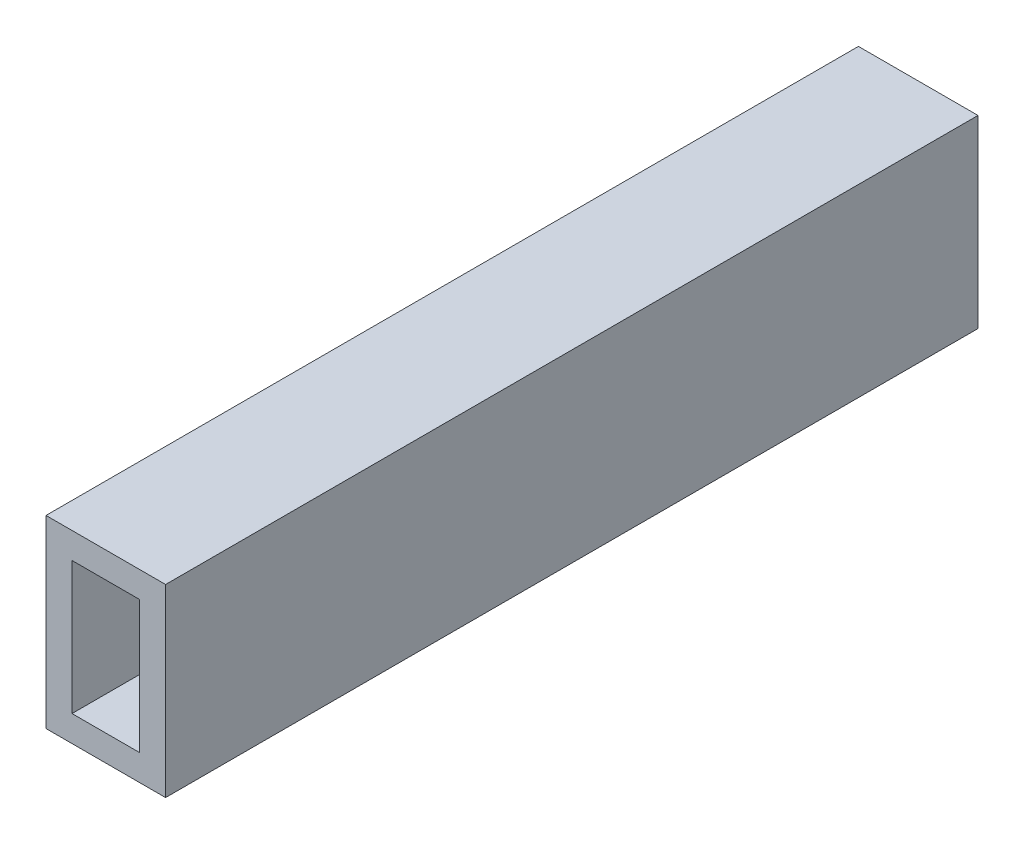
ISO-10303-21;
HEADER;
FILE_DESCRIPTION(('STEP AP214'),'2;1');
FILE_NAME('part.step','',(''),(''),'','','');
FILE_SCHEMA(('AUTOMOTIVE_DESIGN { 1 0 10303 214 1 1 1 1 }'));
ENDSEC;
DATA;
#1=APPLICATION_CONTEXT('core data for automotive mechanical design processes');
#2=APPLICATION_PROTOCOL_DEFINITION('international standard','automotive_design',2000,#1);
#3=PRODUCT_CONTEXT('',#1,'mechanical');
#4=PRODUCT('Part','Part','',(#3));
#5=PRODUCT_RELATED_PRODUCT_CATEGORY('part','',(#4));
#6=PRODUCT_DEFINITION_FORMATION('','',#4);
#7=PRODUCT_DEFINITION_CONTEXT('part definition',#1,'design');
#8=PRODUCT_DEFINITION('design','',#6,#7);
#9=PRODUCT_DEFINITION_SHAPE('','',#8);
#10=(LENGTH_UNIT() NAMED_UNIT(*) SI_UNIT(.MILLI.,.METRE.));
#11=(NAMED_UNIT(*) PLANE_ANGLE_UNIT() SI_UNIT($,.RADIAN.));
#12=(NAMED_UNIT(*) SI_UNIT($,.STERADIAN.) SOLID_ANGLE_UNIT());
#13=UNCERTAINTY_MEASURE_WITH_UNIT(LENGTH_MEASURE(1.E-05),#10,'distance_accuracy_value','');
#14=(GEOMETRIC_REPRESENTATION_CONTEXT(3) GLOBAL_UNCERTAINTY_ASSIGNED_CONTEXT((#13)) GLOBAL_UNIT_ASSIGNED_CONTEXT((#10,
#11,#12)) REPRESENTATION_CONTEXT('',''));
#15=CARTESIAN_POINT('',(0.,0.,0.));
#16=DIRECTION('',(0.,0.,1.));
#17=DIRECTION('',(1.,0.,0.));
#18=AXIS2_PLACEMENT_3D('',#15,#16,#17);
#19=CARTESIAN_POINT('',(0.,0.,31.25));
#20=DIRECTION('',(0.,0.,-1.));
#21=DIRECTION('',(-1.,0.,0.));
#22=AXIS2_PLACEMENT_3D('',#19,#20,#21);
#23=PLANE('',#22);
#24=DIRECTION('',(0.,1.,0.));
#25=VECTOR('',#24,1.);
#26=CARTESIAN_POINT('',(2.3,-3.55,31.25));
#27=LINE('',#26,#25);
#28=CARTESIAN_POINT('',(2.3,-3.55,31.25));
#29=VERTEX_POINT('',#28);
#30=CARTESIAN_POINT('',(2.3,3.55,31.25));
#31=VERTEX_POINT('',#30);
#32=EDGE_CURVE('E153',#29,#31,#27,.T.);
#33=ORIENTED_EDGE('',*,*,#32,.T.);
#34=DIRECTION('',(-1.,0.,0.));
#35=VECTOR('',#34,1.);
#36=CARTESIAN_POINT('',(-2.3,3.55,31.25));
#37=LINE('',#36,#35);
#38=CARTESIAN_POINT('',(-2.3,3.55,31.25));
#39=VERTEX_POINT('',#38);
#40=EDGE_CURVE('E157',#31,#39,#37,.T.);
#41=ORIENTED_EDGE('',*,*,#40,.T.);
#42=DIRECTION('',(0.,-1.,0.));
#43=VECTOR('',#42,1.);
#44=CARTESIAN_POINT('',(-2.3,-3.55,31.25));
#45=LINE('',#44,#43);
#46=CARTESIAN_POINT('',(-2.3,-3.55,31.25));
#47=VERTEX_POINT('',#46);
#48=EDGE_CURVE('E161',#39,#47,#45,.T.);
#49=ORIENTED_EDGE('',*,*,#48,.T.);
#50=DIRECTION('',(1.,0.,0.));
#51=VECTOR('',#50,1.);
#52=CARTESIAN_POINT('',(-2.3,-3.55,31.25));
#53=LINE('',#52,#51);
#54=EDGE_CURVE('E164',#47,#29,#53,.T.);
#55=ORIENTED_EDGE('',*,*,#54,.T.);
#56=EDGE_LOOP('',(#33,#41,#49,#55));
#57=FACE_BOUND('',#56,.T.);
#58=DIRECTION('',(0.,-1.,0.));
#59=VECTOR('',#58,1.);
#60=CARTESIAN_POINT('',(-1.3,-2.55,31.25));
#61=LINE('',#60,#59);
#62=CARTESIAN_POINT('',(-1.3,2.55,31.25));
#63=VERTEX_POINT('',#62);
#64=CARTESIAN_POINT('',(-1.3,-2.55,31.25));
#65=VERTEX_POINT('',#64);
#66=EDGE_CURVE('E105',#63,#65,#61,.T.);
#67=ORIENTED_EDGE('',*,*,#66,.F.);
#68=DIRECTION('',(-1.,0.,0.));
#69=VECTOR('',#68,1.);
#70=CARTESIAN_POINT('',(1.3,2.55,31.25));
#71=LINE('',#70,#69);
#72=CARTESIAN_POINT('',(1.3,2.55,31.25));
#73=VERTEX_POINT('',#72);
#74=EDGE_CURVE('E131',#73,#63,#71,.T.);
#75=ORIENTED_EDGE('',*,*,#74,.F.);
#76=DIRECTION('',(0.,1.,0.));
#77=VECTOR('',#76,1.);
#78=CARTESIAN_POINT('',(1.3,-2.55,31.25));
#79=LINE('',#78,#77);
#80=CARTESIAN_POINT('',(1.3,-2.55,31.25));
#81=VERTEX_POINT('',#80);
#82=EDGE_CURVE('E127',#81,#73,#79,.T.);
#83=ORIENTED_EDGE('',*,*,#82,.F.);
#84=DIRECTION('',(1.,0.,0.));
#85=VECTOR('',#84,1.);
#86=CARTESIAN_POINT('',(1.3,-2.55,31.25));
#87=LINE('',#86,#85);
#88=EDGE_CURVE('E114',#65,#81,#87,.T.);
#89=ORIENTED_EDGE('',*,*,#88,.F.);
#90=EDGE_LOOP('',(#67,#75,#83,#89));
#91=FACE_BOUND('',#90,.T.);
#92=ADVANCED_FACE('F39',(#57,#91),#23,.F.);
#93=CARTESIAN_POINT('',(0.,0.,0.));
#94=DIRECTION('',(0.,0.,-1.));
#95=DIRECTION('',(-1.,0.,0.));
#96=AXIS2_PLACEMENT_3D('',#93,#94,#95);
#97=PLANE('',#96);
#98=DIRECTION('',(0.,1.,0.));
#99=VECTOR('',#98,1.);
#100=CARTESIAN_POINT('',(2.3,-3.55,0.));
#101=LINE('',#100,#99);
#102=CARTESIAN_POINT('',(2.3,-3.55,0.));
#103=VERTEX_POINT('',#102);
#104=CARTESIAN_POINT('',(2.3,3.55,0.));
#105=VERTEX_POINT('',#104);
#106=EDGE_CURVE('E123',#103,#105,#101,.T.);
#107=ORIENTED_EDGE('',*,*,#106,.F.);
#108=DIRECTION('',(1.,0.,0.));
#109=VECTOR('',#108,1.);
#110=CARTESIAN_POINT('',(-2.3,-3.55,0.));
#111=LINE('',#110,#109);
#112=CARTESIAN_POINT('',(-2.3,-3.55,0.));
#113=VERTEX_POINT('',#112);
#114=EDGE_CURVE('E158',#113,#103,#111,.T.);
#115=ORIENTED_EDGE('',*,*,#114,.F.);
#116=DIRECTION('',(0.,-1.,0.));
#117=VECTOR('',#116,1.);
#118=CARTESIAN_POINT('',(-2.3,-3.55,0.));
#119=LINE('',#118,#117);
#120=CARTESIAN_POINT('',(-2.3,3.55,0.));
#121=VERTEX_POINT('',#120);
#122=EDGE_CURVE('E174',#121,#113,#119,.T.);
#123=ORIENTED_EDGE('',*,*,#122,.F.);
#124=DIRECTION('',(-1.,0.,0.));
#125=VECTOR('',#124,1.);
#126=CARTESIAN_POINT('',(-2.3,3.55,0.));
#127=LINE('',#126,#125);
#128=EDGE_CURVE('E171',#105,#121,#127,.T.);
#129=ORIENTED_EDGE('',*,*,#128,.F.);
#130=EDGE_LOOP('',(#107,#115,#123,#129));
#131=FACE_BOUND('',#130,.T.);
#132=DIRECTION('',(-1.,0.,0.));
#133=VECTOR('',#132,1.);
#134=CARTESIAN_POINT('',(1.3,2.55,0.));
#135=LINE('',#134,#133);
#136=CARTESIAN_POINT('',(1.3,2.55,0.));
#137=VERTEX_POINT('',#136);
#138=CARTESIAN_POINT('',(-1.3,2.55,0.));
#139=VERTEX_POINT('',#138);
#140=EDGE_CURVE('E115',#137,#139,#135,.T.);
#141=ORIENTED_EDGE('',*,*,#140,.T.);
#142=DIRECTION('',(0.,-1.,0.));
#143=VECTOR('',#142,1.);
#144=CARTESIAN_POINT('',(-1.3,-2.55,0.));
#145=LINE('',#144,#143);
#146=CARTESIAN_POINT('',(-1.3,-2.55,0.));
#147=VERTEX_POINT('',#146);
#148=EDGE_CURVE('E63',#139,#147,#145,.T.);
#149=ORIENTED_EDGE('',*,*,#148,.T.);
#150=DIRECTION('',(1.,0.,0.));
#151=VECTOR('',#150,1.);
#152=CARTESIAN_POINT('',(1.3,-2.55,0.));
#153=LINE('',#152,#151);
#154=CARTESIAN_POINT('',(1.3,-2.55,0.));
#155=VERTEX_POINT('',#154);
#156=EDGE_CURVE('E121',#147,#155,#153,.T.);
#157=ORIENTED_EDGE('',*,*,#156,.T.);
#158=DIRECTION('',(0.,1.,0.));
#159=VECTOR('',#158,1.);
#160=CARTESIAN_POINT('',(1.3,-2.55,0.));
#161=LINE('',#160,#159);
#162=EDGE_CURVE('E140',#155,#137,#161,.T.);
#163=ORIENTED_EDGE('',*,*,#162,.T.);
#164=EDGE_LOOP('',(#141,#149,#157,#163));
#165=FACE_BOUND('',#164,.T.);
#166=ADVANCED_FACE('F197',(#131,#165),#97,.T.);
#167=CARTESIAN_POINT('',(2.3,-3.55,31.25));
#168=DIRECTION('',(-1.,0.,0.));
#169=DIRECTION('',(0.,0.,1.));
#170=AXIS2_PLACEMENT_3D('',#167,#168,#169);
#171=PLANE('',#170);
#172=ORIENTED_EDGE('',*,*,#106,.T.);
#173=DIRECTION('',(0.,0.,-1.));
#174=VECTOR('',#173,1.);
#175=CARTESIAN_POINT('',(2.3,3.55,31.25));
#176=LINE('',#175,#174);
#177=EDGE_CURVE('E11',#31,#105,#176,.T.);
#178=ORIENTED_EDGE('',*,*,#177,.F.);
#179=ORIENTED_EDGE('',*,*,#32,.F.);
#180=DIRECTION('',(0.,0.,-1.));
#181=VECTOR('',#180,1.);
#182=CARTESIAN_POINT('',(2.3,-3.55,31.25));
#183=LINE('',#182,#181);
#184=EDGE_CURVE('E167',#29,#103,#183,.T.);
#185=ORIENTED_EDGE('',*,*,#184,.T.);
#186=EDGE_LOOP('',(#172,#178,#179,#185));
#187=FACE_BOUND('',#186,.T.);
#188=ADVANCED_FACE('F41',(#187),#171,.F.);
#189=CARTESIAN_POINT('',(-2.3,3.55,31.25));
#190=DIRECTION('',(0.,-1.,0.));
#191=DIRECTION('',(0.,0.,-1.));
#192=AXIS2_PLACEMENT_3D('',#189,#190,#191);
#193=PLANE('',#192);
#194=ORIENTED_EDGE('',*,*,#128,.T.);
#195=DIRECTION('',(0.,0.,-1.));
#196=VECTOR('',#195,1.);
#197=CARTESIAN_POINT('',(-2.3,3.55,31.25));
#198=LINE('',#197,#196);
#199=EDGE_CURVE('E48',#39,#121,#198,.T.);
#200=ORIENTED_EDGE('',*,*,#199,.F.);
#201=ORIENTED_EDGE('',*,*,#40,.F.);
#202=ORIENTED_EDGE('',*,*,#177,.T.);
#203=EDGE_LOOP('',(#194,#200,#201,#202));
#204=FACE_BOUND('',#203,.T.);
#205=ADVANCED_FACE('F207',(#204),#193,.F.);
#206=CARTESIAN_POINT('',(-2.3,-3.55,31.25));
#207=DIRECTION('',(1.,0.,0.));
#208=DIRECTION('',(0.,0.,-1.));
#209=AXIS2_PLACEMENT_3D('',#206,#207,#208);
#210=PLANE('',#209);
#211=ORIENTED_EDGE('',*,*,#122,.T.);
#212=DIRECTION('',(0.,0.,-1.));
#213=VECTOR('',#212,1.);
#214=CARTESIAN_POINT('',(-2.3,-3.55,31.25));
#215=LINE('',#214,#213);
#216=EDGE_CURVE('E182',#47,#113,#215,.T.);
#217=ORIENTED_EDGE('',*,*,#216,.F.);
#218=ORIENTED_EDGE('',*,*,#48,.F.);
#219=ORIENTED_EDGE('',*,*,#199,.T.);
#220=EDGE_LOOP('',(#211,#217,#218,#219));
#221=FACE_BOUND('',#220,.T.);
#222=ADVANCED_FACE('F191',(#221),#210,.F.);
#223=CARTESIAN_POINT('',(-2.3,-3.55,31.25));
#224=DIRECTION('',(0.,1.,0.));
#225=DIRECTION('',(0.,0.,1.));
#226=AXIS2_PLACEMENT_3D('',#223,#224,#225);
#227=PLANE('',#226);
#228=ORIENTED_EDGE('',*,*,#114,.T.);
#229=ORIENTED_EDGE('',*,*,#184,.F.);
#230=ORIENTED_EDGE('',*,*,#54,.F.);
#231=ORIENTED_EDGE('',*,*,#216,.T.);
#232=EDGE_LOOP('',(#228,#229,#230,#231));
#233=FACE_BOUND('',#232,.T.);
#234=ADVANCED_FACE('F201',(#233),#227,.F.);
#235=CARTESIAN_POINT('',(-1.3,-2.55,31.25));
#236=DIRECTION('',(1.,0.,0.));
#237=DIRECTION('',(0.,1.,0.));
#238=AXIS2_PLACEMENT_3D('',#235,#236,#237);
#239=PLANE('',#238);
#240=ORIENTED_EDGE('',*,*,#148,.F.);
#241=DIRECTION('',(0.,0.,-1.));
#242=VECTOR('',#241,1.);
#243=CARTESIAN_POINT('',(-1.3,2.55,31.25));
#244=LINE('',#243,#242);
#245=EDGE_CURVE('E109',#63,#139,#244,.T.);
#246=ORIENTED_EDGE('',*,*,#245,.F.);
#247=ORIENTED_EDGE('',*,*,#66,.T.);
#248=DIRECTION('',(0.,0.,-1.));
#249=VECTOR('',#248,1.);
#250=CARTESIAN_POINT('',(-1.3,-2.55,31.25));
#251=LINE('',#250,#249);
#252=EDGE_CURVE('E108',#65,#147,#251,.T.);
#253=ORIENTED_EDGE('',*,*,#252,.T.);
#254=EDGE_LOOP('',(#240,#246,#247,#253));
#255=FACE_BOUND('',#254,.T.);
#256=ADVANCED_FACE('F107',(#255),#239,.T.);
#257=CARTESIAN_POINT('',(1.3,-2.55,31.25));
#258=DIRECTION('',(0.,1.,0.));
#259=DIRECTION('',(0.,0.,1.));
#260=AXIS2_PLACEMENT_3D('',#257,#258,#259);
#261=PLANE('',#260);
#262=ORIENTED_EDGE('',*,*,#156,.F.);
#263=ORIENTED_EDGE('',*,*,#252,.F.);
#264=ORIENTED_EDGE('',*,*,#88,.T.);
#265=DIRECTION('',(0.,0.,-1.));
#266=VECTOR('',#265,1.);
#267=CARTESIAN_POINT('',(1.3,-2.55,31.25));
#268=LINE('',#267,#266);
#269=EDGE_CURVE('E124',#81,#155,#268,.T.);
#270=ORIENTED_EDGE('',*,*,#269,.T.);
#271=EDGE_LOOP('',(#262,#263,#264,#270));
#272=FACE_BOUND('',#271,.T.);
#273=ADVANCED_FACE('F118',(#272),#261,.T.);
#274=CARTESIAN_POINT('',(1.3,-2.55,31.25));
#275=DIRECTION('',(-1.,0.,0.));
#276=DIRECTION('',(0.,-1.,0.));
#277=AXIS2_PLACEMENT_3D('',#274,#275,#276);
#278=PLANE('',#277);
#279=ORIENTED_EDGE('',*,*,#162,.F.);
#280=ORIENTED_EDGE('',*,*,#269,.F.);
#281=ORIENTED_EDGE('',*,*,#82,.T.);
#282=DIRECTION('',(0.,0.,-1.));
#283=VECTOR('',#282,1.);
#284=CARTESIAN_POINT('',(1.3,2.55,31.25));
#285=LINE('',#284,#283);
#286=EDGE_CURVE('E55',#73,#137,#285,.T.);
#287=ORIENTED_EDGE('',*,*,#286,.T.);
#288=EDGE_LOOP('',(#279,#280,#281,#287));
#289=FACE_BOUND('',#288,.T.);
#290=ADVANCED_FACE('F230',(#289),#278,.T.);
#291=CARTESIAN_POINT('',(1.3,2.55,31.25));
#292=DIRECTION('',(0.,-1.,0.));
#293=DIRECTION('',(0.,0.,-1.));
#294=AXIS2_PLACEMENT_3D('',#291,#292,#293);
#295=PLANE('',#294);
#296=ORIENTED_EDGE('',*,*,#140,.F.);
#297=ORIENTED_EDGE('',*,*,#286,.F.);
#298=ORIENTED_EDGE('',*,*,#74,.T.);
#299=ORIENTED_EDGE('',*,*,#245,.T.);
#300=EDGE_LOOP('',(#296,#297,#298,#299));
#301=FACE_BOUND('',#300,.T.);
#302=ADVANCED_FACE('F234',(#301),#295,.T.);
#303=CLOSED_SHELL('',(#92,#166,#188,#205,#222,#234,#256,#273,#290,#302));
#304=MANIFOLD_SOLID_BREP('B2',#303);
#305=ADVANCED_BREP_SHAPE_REPRESENTATION('',(#18,#304),#14);
#306=SHAPE_DEFINITION_REPRESENTATION(#9,#305);
ENDSEC;
END-ISO-10303-21;
